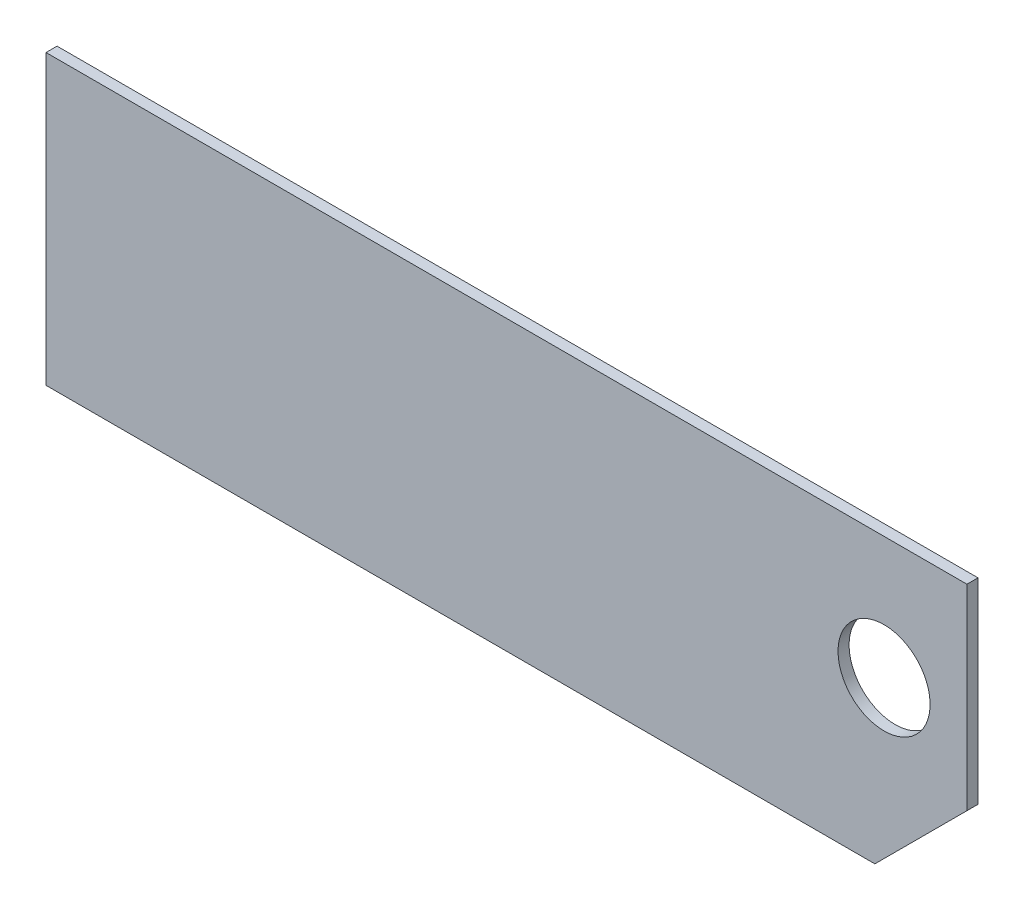
ISO-10303-21;
HEADER;
FILE_DESCRIPTION(('STEP AP214'),'2;1');
FILE_NAME('part.step','',(''),(''),'','','');
FILE_SCHEMA(('AUTOMOTIVE_DESIGN { 1 0 10303 214 1 1 1 1 }'));
ENDSEC;
DATA;
#1=APPLICATION_CONTEXT('core data for automotive mechanical design processes');
#2=APPLICATION_PROTOCOL_DEFINITION('international standard','automotive_design',2000,#1);
#3=PRODUCT_CONTEXT('',#1,'mechanical');
#4=PRODUCT('Part','Part','',(#3));
#5=PRODUCT_RELATED_PRODUCT_CATEGORY('part','',(#4));
#6=PRODUCT_DEFINITION_FORMATION('','',#4);
#7=PRODUCT_DEFINITION_CONTEXT('part definition',#1,'design');
#8=PRODUCT_DEFINITION('design','',#6,#7);
#9=PRODUCT_DEFINITION_SHAPE('','',#8);
#10=(LENGTH_UNIT() NAMED_UNIT(*) SI_UNIT(.MILLI.,.METRE.));
#11=(NAMED_UNIT(*) PLANE_ANGLE_UNIT() SI_UNIT($,.RADIAN.));
#12=(NAMED_UNIT(*) SI_UNIT($,.STERADIAN.) SOLID_ANGLE_UNIT());
#13=UNCERTAINTY_MEASURE_WITH_UNIT(LENGTH_MEASURE(1.E-05),#10,'distance_accuracy_value','');
#14=(GEOMETRIC_REPRESENTATION_CONTEXT(3) GLOBAL_UNCERTAINTY_ASSIGNED_CONTEXT((#13)) GLOBAL_UNIT_ASSIGNED_CONTEXT((#10,
#11,#12)) REPRESENTATION_CONTEXT('',''));
#15=CARTESIAN_POINT('',(0.,0.,0.));
#16=DIRECTION('',(0.,0.,1.));
#17=DIRECTION('',(1.,0.,0.));
#18=AXIS2_PLACEMENT_3D('',#15,#16,#17);
#19=CARTESIAN_POINT('',(-139.812818371494,47.1171062326941,0.75));
#20=DIRECTION('',(-1.,0.,0.));
#21=DIRECTION('',(0.,0.,1.));
#22=AXIS2_PLACEMENT_3D('',#19,#20,#21);
#23=PLANE('',#22);
#24=DIRECTION('',(0.,-1.,0.));
#25=VECTOR('',#24,1.);
#26=CARTESIAN_POINT('',(-139.812818371494,47.1171062326941,5.25));
#27=LINE('',#26,#25);
#28=CARTESIAN_POINT('',(-139.812818371494,47.1171062326941,5.25));
#29=VERTEX_POINT('',#28);
#30=CARTESIAN_POINT('',(-139.812818371494,-70.2578937673059,5.25));
#31=VERTEX_POINT('',#30);
#32=EDGE_CURVE('E111',#29,#31,#27,.T.);
#33=ORIENTED_EDGE('',*,*,#32,.F.);
#34=DIRECTION('',(0.,0.,1.));
#35=VECTOR('',#34,1.);
#36=CARTESIAN_POINT('',(-139.812818371494,47.1171062326941,0.75));
#37=LINE('',#36,#35);
#38=CARTESIAN_POINT('',(-139.812818371494,47.1171062326941,0.75));
#39=VERTEX_POINT('',#38);
#40=EDGE_CURVE('E11',#39,#29,#37,.T.);
#41=ORIENTED_EDGE('',*,*,#40,.F.);
#42=DIRECTION('',(0.,-1.,0.));
#43=VECTOR('',#42,1.);
#44=CARTESIAN_POINT('',(-139.812818371494,47.1171062326941,0.75));
#45=LINE('',#44,#43);
#46=CARTESIAN_POINT('',(-139.812818371494,-70.2578937673059,0.75));
#47=VERTEX_POINT('',#46);
#48=EDGE_CURVE('E106',#39,#47,#45,.T.);
#49=ORIENTED_EDGE('',*,*,#48,.T.);
#50=DIRECTION('',(0.,0.,1.));
#51=VECTOR('',#50,1.);
#52=CARTESIAN_POINT('',(-139.812818371494,-70.2578937673059,0.75));
#53=LINE('',#52,#51);
#54=EDGE_CURVE('E37',#47,#31,#53,.T.);
#55=ORIENTED_EDGE('',*,*,#54,.T.);
#56=EDGE_LOOP('',(#33,#41,#49,#55));
#57=FACE_BOUND('',#56,.T.);
#58=ADVANCED_FACE('F34',(#57),#23,.T.);
#59=CARTESIAN_POINT('',(235.187181628506,47.1171062326941,0.75));
#60=DIRECTION('',(0.,1.,0.));
#61=DIRECTION('',(0.,0.,1.));
#62=AXIS2_PLACEMENT_3D('',#59,#60,#61);
#63=PLANE('',#62);
#64=DIRECTION('',(-1.,0.,0.));
#65=VECTOR('',#64,1.);
#66=CARTESIAN_POINT('',(235.187181628506,47.1171062326941,5.25));
#67=LINE('',#66,#65);
#68=CARTESIAN_POINT('',(235.187181628506,47.1171062326941,5.25));
#69=VERTEX_POINT('',#68);
#70=EDGE_CURVE('E121',#69,#29,#67,.T.);
#71=ORIENTED_EDGE('',*,*,#70,.F.);
#72=DIRECTION('',(0.,0.,1.));
#73=VECTOR('',#72,1.);
#74=CARTESIAN_POINT('',(235.187181628506,47.1171062326941,0.75));
#75=LINE('',#74,#73);
#76=CARTESIAN_POINT('',(235.187181628506,47.1171062326941,0.75));
#77=VERTEX_POINT('',#76);
#78=EDGE_CURVE('E43',#77,#69,#75,.T.);
#79=ORIENTED_EDGE('',*,*,#78,.F.);
#80=DIRECTION('',(-1.,0.,0.));
#81=VECTOR('',#80,1.);
#82=CARTESIAN_POINT('',(235.187181628506,47.1171062326941,0.75));
#83=LINE('',#82,#81);
#84=EDGE_CURVE('E101',#77,#39,#83,.T.);
#85=ORIENTED_EDGE('',*,*,#84,.T.);
#86=ORIENTED_EDGE('',*,*,#40,.T.);
#87=EDGE_LOOP('',(#71,#79,#85,#86));
#88=FACE_BOUND('',#87,.T.);
#89=ADVANCED_FACE('F127',(#88),#63,.T.);
#90=CARTESIAN_POINT('',(235.187181628506,-32.7578937673059,0.75));
#91=DIRECTION('',(1.,0.,0.));
#92=DIRECTION('',(0.,0.,-1.));
#93=AXIS2_PLACEMENT_3D('',#90,#91,#92);
#94=PLANE('',#93);
#95=DIRECTION('',(0.,1.,0.));
#96=VECTOR('',#95,1.);
#97=CARTESIAN_POINT('',(235.187181628506,-32.7578937673059,5.25));
#98=LINE('',#97,#96);
#99=CARTESIAN_POINT('',(235.187181628506,-32.7578937673059,5.25));
#100=VERTEX_POINT('',#99);
#101=EDGE_CURVE('E90',#100,#69,#98,.T.);
#102=ORIENTED_EDGE('',*,*,#101,.F.);
#103=DIRECTION('',(0.,0.,1.));
#104=VECTOR('',#103,1.);
#105=CARTESIAN_POINT('',(235.187181628506,-32.7578937673059,0.75));
#106=LINE('',#105,#104);
#107=CARTESIAN_POINT('',(235.187181628506,-32.7578937673059,0.75));
#108=VERTEX_POINT('',#107);
#109=EDGE_CURVE('E85',#108,#100,#106,.T.);
#110=ORIENTED_EDGE('',*,*,#109,.F.);
#111=DIRECTION('',(0.,1.,0.));
#112=VECTOR('',#111,1.);
#113=CARTESIAN_POINT('',(235.187181628506,-32.7578937673059,0.75));
#114=LINE('',#113,#112);
#115=EDGE_CURVE('E88',#108,#77,#114,.T.);
#116=ORIENTED_EDGE('',*,*,#115,.T.);
#117=ORIENTED_EDGE('',*,*,#78,.T.);
#118=EDGE_LOOP('',(#102,#110,#116,#117));
#119=FACE_BOUND('',#118,.T.);
#120=ADVANCED_FACE('F87',(#119),#94,.T.);
#121=CARTESIAN_POINT('',(197.687181628506,-70.2578937673059,0.75));
#122=DIRECTION('',(0.707106781186548,-0.707106781186548,0.));
#123=DIRECTION('',(0.707106781186548,0.707106781186548,0.));
#124=AXIS2_PLACEMENT_3D('',#121,#122,#123);
#125=PLANE('',#124);
#126=DIRECTION('',(0.707106781186547,0.707106781186547,0.));
#127=VECTOR('',#126,1.);
#128=CARTESIAN_POINT('',(197.687181628506,-70.2578937673059,5.25));
#129=LINE('',#128,#127);
#130=CARTESIAN_POINT('',(197.687181628506,-70.2578937673059,5.25));
#131=VERTEX_POINT('',#130);
#132=EDGE_CURVE('E118',#131,#100,#129,.T.);
#133=ORIENTED_EDGE('',*,*,#132,.F.);
#134=DIRECTION('',(0.,0.,1.));
#135=VECTOR('',#134,1.);
#136=CARTESIAN_POINT('',(197.687181628506,-70.2578937673059,0.75));
#137=LINE('',#136,#135);
#138=CARTESIAN_POINT('',(197.687181628506,-70.2578937673059,0.75));
#139=VERTEX_POINT('',#138);
#140=EDGE_CURVE('E95',#139,#131,#137,.T.);
#141=ORIENTED_EDGE('',*,*,#140,.F.);
#142=DIRECTION('',(0.707106781186547,0.707106781186547,0.));
#143=VECTOR('',#142,1.);
#144=CARTESIAN_POINT('',(197.687181628506,-70.2578937673059,0.75));
#145=LINE('',#144,#143);
#146=EDGE_CURVE('E100',#139,#108,#145,.T.);
#147=ORIENTED_EDGE('',*,*,#146,.T.);
#148=ORIENTED_EDGE('',*,*,#109,.T.);
#149=EDGE_LOOP('',(#133,#141,#147,#148));
#150=FACE_BOUND('',#149,.T.);
#151=ADVANCED_FACE('F103',(#150),#125,.T.);
#152=CARTESIAN_POINT('',(-139.812818371494,-70.2578937673059,0.75));
#153=DIRECTION('',(0.,-1.,0.));
#154=DIRECTION('',(0.,0.,-1.));
#155=AXIS2_PLACEMENT_3D('',#152,#153,#154);
#156=PLANE('',#155);
#157=DIRECTION('',(1.,0.,0.));
#158=VECTOR('',#157,1.);
#159=CARTESIAN_POINT('',(-139.812818371494,-70.2578937673059,5.25));
#160=LINE('',#159,#158);
#161=EDGE_CURVE('E114',#31,#131,#160,.T.);
#162=ORIENTED_EDGE('',*,*,#161,.F.);
#163=ORIENTED_EDGE('',*,*,#54,.F.);
#164=DIRECTION('',(1.,0.,0.));
#165=VECTOR('',#164,1.);
#166=CARTESIAN_POINT('',(-139.812818371494,-70.2578937673059,0.75));
#167=LINE('',#166,#165);
#168=EDGE_CURVE('E104',#47,#139,#167,.T.);
#169=ORIENTED_EDGE('',*,*,#168,.T.);
#170=ORIENTED_EDGE('',*,*,#140,.T.);
#171=EDGE_LOOP('',(#162,#163,#169,#170));
#172=FACE_BOUND('',#171,.T.);
#173=ADVANCED_FACE('F124',(#172),#156,.T.);
#174=CARTESIAN_POINT('',(10.1871816285055,-2.75789376730586,0.75));
#175=DIRECTION('',(0.,0.,1.));
#176=DIRECTION('',(1.,0.,0.));
#177=AXIS2_PLACEMENT_3D('',#174,#175,#176);
#178=PLANE('',#177);
#179=CARTESIAN_POINT('',(201.437181628506,-2.75789376730586,0.75));
#180=DIRECTION('',(0.,0.,1.));
#181=DIRECTION('',(-1.,0.,0.));
#182=AXIS2_PLACEMENT_3D('',#179,#180,#181);
#183=CIRCLE('',#182,18.75);
#184=CARTESIAN_POINT('',(182.687181628506,-2.75789376730586,0.75));
#185=VERTEX_POINT('',#184);
#186=EDGE_CURVE('E115',#185,#185,#183,.T.);
#187=ORIENTED_EDGE('',*,*,#186,.T.);
#188=EDGE_LOOP('',(#187));
#189=FACE_BOUND('',#188,.T.);
#190=ORIENTED_EDGE('',*,*,#48,.F.);
#191=ORIENTED_EDGE('',*,*,#84,.F.);
#192=ORIENTED_EDGE('',*,*,#115,.F.);
#193=ORIENTED_EDGE('',*,*,#146,.F.);
#194=ORIENTED_EDGE('',*,*,#168,.F.);
#195=EDGE_LOOP('',(#190,#191,#192,#193,#194));
#196=FACE_BOUND('',#195,.T.);
#197=ADVANCED_FACE('F99',(#189,#196),#178,.F.);
#198=CARTESIAN_POINT('',(10.1871816285055,-2.75789376730586,5.25));
#199=DIRECTION('',(0.,0.,1.));
#200=DIRECTION('',(1.,0.,0.));
#201=AXIS2_PLACEMENT_3D('',#198,#199,#200);
#202=PLANE('',#201);
#203=CARTESIAN_POINT('',(201.437181628506,-2.75789376730586,5.25));
#204=DIRECTION('',(0.,0.,1.));
#205=DIRECTION('',(-1.,0.,0.));
#206=AXIS2_PLACEMENT_3D('',#203,#204,#205);
#207=CIRCLE('',#206,18.75);
#208=CARTESIAN_POINT('',(182.687181628506,-2.75789376730586,5.25));
#209=VERTEX_POINT('',#208);
#210=EDGE_CURVE('E159',#209,#209,#207,.T.);
#211=ORIENTED_EDGE('',*,*,#210,.F.);
#212=EDGE_LOOP('',(#211));
#213=FACE_BOUND('',#212,.T.);
#214=ORIENTED_EDGE('',*,*,#32,.T.);
#215=ORIENTED_EDGE('',*,*,#161,.T.);
#216=ORIENTED_EDGE('',*,*,#132,.T.);
#217=ORIENTED_EDGE('',*,*,#101,.T.);
#218=ORIENTED_EDGE('',*,*,#70,.T.);
#219=EDGE_LOOP('',(#214,#215,#216,#217,#218));
#220=FACE_BOUND('',#219,.T.);
#221=ADVANCED_FACE('F126',(#213,#220),#202,.T.);
#222=CARTESIAN_POINT('',(201.437181628506,-2.75789376730586,0.75));
#223=DIRECTION('',(0.,0.,1.));
#224=DIRECTION('',(1.,0.,0.));
#225=AXIS2_PLACEMENT_3D('',#222,#223,#224);
#226=CYLINDRICAL_SURFACE('',#225,18.75);
#227=ORIENTED_EDGE('',*,*,#186,.F.);
#228=EDGE_LOOP('',(#227));
#229=FACE_BOUND('',#228,.T.);
#230=ORIENTED_EDGE('',*,*,#210,.T.);
#231=EDGE_LOOP('',(#230));
#232=FACE_BOUND('',#231,.T.);
#233=ADVANCED_FACE('F147',(#229,#232),#226,.F.);
#234=CLOSED_SHELL('',(#58,#89,#120,#151,#173,#197,#221,#233));
#235=MANIFOLD_SOLID_BREP('B2',#234);
#236=ADVANCED_BREP_SHAPE_REPRESENTATION('',(#18,#235),#14);
#237=SHAPE_DEFINITION_REPRESENTATION(#9,#236);
ENDSEC;
END-ISO-10303-21;
